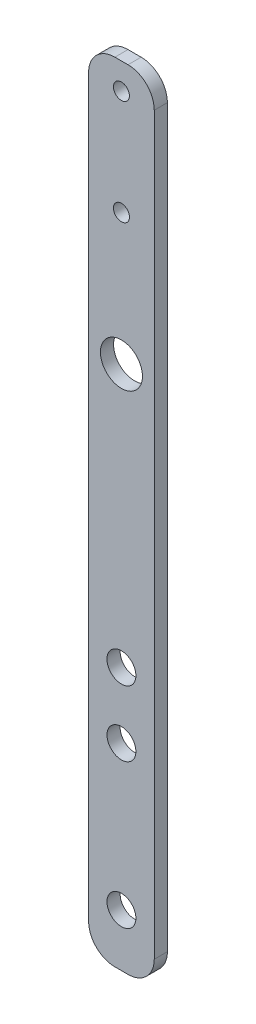
ISO-10303-21;
HEADER;
FILE_DESCRIPTION(('STEP AP214'),'2;1');
FILE_NAME('part.step','',(''),(''),'','','');
FILE_SCHEMA(('AUTOMOTIVE_DESIGN { 1 0 10303 214 1 1 1 1 }'));
ENDSEC;
DATA;
#1=APPLICATION_CONTEXT('core data for automotive mechanical design processes');
#2=APPLICATION_PROTOCOL_DEFINITION('international standard','automotive_design',2000,#1);
#3=PRODUCT_CONTEXT('',#1,'mechanical');
#4=PRODUCT('Part','Part','',(#3));
#5=PRODUCT_RELATED_PRODUCT_CATEGORY('part','',(#4));
#6=PRODUCT_DEFINITION_FORMATION('','',#4);
#7=PRODUCT_DEFINITION_CONTEXT('part definition',#1,'design');
#8=PRODUCT_DEFINITION('design','',#6,#7);
#9=PRODUCT_DEFINITION_SHAPE('','',#8);
#10=(LENGTH_UNIT() NAMED_UNIT(*) SI_UNIT(.MILLI.,.METRE.));
#11=(NAMED_UNIT(*) PLANE_ANGLE_UNIT() SI_UNIT($,.RADIAN.));
#12=(NAMED_UNIT(*) SI_UNIT($,.STERADIAN.) SOLID_ANGLE_UNIT());
#13=UNCERTAINTY_MEASURE_WITH_UNIT(LENGTH_MEASURE(1.E-05),#10,'distance_accuracy_value','');
#14=(GEOMETRIC_REPRESENTATION_CONTEXT(3) GLOBAL_UNCERTAINTY_ASSIGNED_CONTEXT((#13)) GLOBAL_UNIT_ASSIGNED_CONTEXT((#10,
#11,#12)) REPRESENTATION_CONTEXT('',''));
#15=CARTESIAN_POINT('',(0.,0.,0.));
#16=DIRECTION('',(0.,0.,1.));
#17=DIRECTION('',(1.,0.,0.));
#18=AXIS2_PLACEMENT_3D('',#15,#16,#17);
#19=CARTESIAN_POINT('',(12.5,-150.,-5.));
#20=DIRECTION('',(1.,0.,0.));
#21=DIRECTION('',(0.,0.,-0.999999999999996));
#22=AXIS2_PLACEMENT_3D('',#19,#20,#21);
#23=PLANE('',#22);
#24=DIRECTION('',(0.,1.,0.));
#25=VECTOR('',#24,1.);
#26=CARTESIAN_POINT('',(12.5,-150.,0.));
#27=LINE('',#26,#25);
#28=CARTESIAN_POINT('',(12.5,-140.,0.));
#29=VERTEX_POINT('',#28);
#30=CARTESIAN_POINT('',(12.5,140.,0.));
#31=VERTEX_POINT('',#30);
#32=EDGE_CURVE('E165',#29,#31,#27,.T.);
#33=ORIENTED_EDGE('',*,*,#32,.F.);
#34=DIRECTION('',(0.,0.,0.999999999999996));
#35=VECTOR('',#34,1.);
#36=CARTESIAN_POINT('',(12.5,-140.,-5.));
#37=LINE('',#36,#35);
#38=CARTESIAN_POINT('',(12.5,-140.,-5.));
#39=VERTEX_POINT('',#38);
#40=EDGE_CURVE('E146',#29,#39,#37,.F.);
#41=ORIENTED_EDGE('',*,*,#40,.T.);
#42=DIRECTION('',(0.,1.,0.));
#43=VECTOR('',#42,1.);
#44=CARTESIAN_POINT('',(12.5,-150.,-5.));
#45=LINE('',#44,#43);
#46=CARTESIAN_POINT('',(12.5,140.,-5.));
#47=VERTEX_POINT('',#46);
#48=EDGE_CURVE('E127',#39,#47,#45,.T.);
#49=ORIENTED_EDGE('',*,*,#48,.T.);
#50=DIRECTION('',(0.,0.,0.999999999999996));
#51=VECTOR('',#50,1.);
#52=CARTESIAN_POINT('',(12.5,140.,-5.));
#53=LINE('',#52,#51);
#54=EDGE_CURVE('E143',#47,#31,#53,.T.);
#55=ORIENTED_EDGE('',*,*,#54,.T.);
#56=EDGE_LOOP('',(#33,#41,#49,#55));
#57=FACE_BOUND('',#56,.T.);
#58=ADVANCED_FACE('F41',(#57),#23,.T.);
#59=CARTESIAN_POINT('',(-12.5,-150.,-4.99999999999998));
#60=DIRECTION('',(0.,-1.,0.));
#61=DIRECTION('',(0.,0.,-0.999999999999996));
#62=AXIS2_PLACEMENT_3D('',#59,#60,#61);
#63=PLANE('',#62);
#64=DIRECTION('',(1.,0.,0.));
#65=VECTOR('',#64,1.);
#66=CARTESIAN_POINT('',(-12.5,-150.,-4.99999999999998));
#67=LINE('',#66,#65);
#68=CARTESIAN_POINT('',(-2.5,-150.,-4.99999999999998));
#69=VERTEX_POINT('',#68);
#70=CARTESIAN_POINT('',(2.5,-150.,-5.));
#71=VERTEX_POINT('',#70);
#72=EDGE_CURVE('E132',#69,#71,#67,.T.);
#73=ORIENTED_EDGE('',*,*,#72,.T.);
#74=DIRECTION('',(0.,0.,0.999999999999996));
#75=VECTOR('',#74,1.);
#76=CARTESIAN_POINT('',(2.5,-150.,-5.));
#77=LINE('',#76,#75);
#78=CARTESIAN_POINT('',(2.5,-150.,0.));
#79=VERTEX_POINT('',#78);
#80=EDGE_CURVE('E126',#71,#79,#77,.T.);
#81=ORIENTED_EDGE('',*,*,#80,.T.);
#82=DIRECTION('',(1.,0.,0.));
#83=VECTOR('',#82,1.);
#84=CARTESIAN_POINT('',(-12.5,-150.,0.));
#85=LINE('',#84,#83);
#86=CARTESIAN_POINT('',(-2.5,-150.,0.));
#87=VERTEX_POINT('',#86);
#88=EDGE_CURVE('E109',#87,#79,#85,.T.);
#89=ORIENTED_EDGE('',*,*,#88,.F.);
#90=DIRECTION('',(0.,0.,0.999999999999996));
#91=VECTOR('',#90,1.);
#92=CARTESIAN_POINT('',(-2.5,-150.,-4.99999999999998));
#93=LINE('',#92,#91);
#94=EDGE_CURVE('E123',#87,#69,#93,.F.);
#95=ORIENTED_EDGE('',*,*,#94,.T.);
#96=EDGE_LOOP('',(#73,#81,#89,#95));
#97=FACE_BOUND('',#96,.T.);
#98=ADVANCED_FACE('F122',(#97),#63,.T.);
#99=CARTESIAN_POINT('',(-12.5,-150.,-4.99999999999998));
#100=DIRECTION('',(-1.,0.,0.));
#101=DIRECTION('',(0.,0.,0.999999999999996));
#102=AXIS2_PLACEMENT_3D('',#99,#100,#101);
#103=PLANE('',#102);
#104=DIRECTION('',(0.,-1.,0.));
#105=VECTOR('',#104,1.);
#106=CARTESIAN_POINT('',(-12.5,-150.,-4.99999999999998));
#107=LINE('',#106,#105);
#108=CARTESIAN_POINT('',(-12.5,140.,-4.99999999999998));
#109=VERTEX_POINT('',#108);
#110=CARTESIAN_POINT('',(-12.5,-140.,-4.99999999999998));
#111=VERTEX_POINT('',#110);
#112=EDGE_CURVE('E136',#109,#111,#107,.T.);
#113=ORIENTED_EDGE('',*,*,#112,.T.);
#114=DIRECTION('',(0.,0.,0.999999999999996));
#115=VECTOR('',#114,1.);
#116=CARTESIAN_POINT('',(-12.5,-140.,-4.99999999999998));
#117=LINE('',#116,#115);
#118=CARTESIAN_POINT('',(-12.5,-140.,0.));
#119=VERTEX_POINT('',#118);
#120=EDGE_CURVE('E156',#111,#119,#117,.T.);
#121=ORIENTED_EDGE('',*,*,#120,.T.);
#122=DIRECTION('',(0.,-1.,0.));
#123=VECTOR('',#122,1.);
#124=CARTESIAN_POINT('',(-12.5,-150.,0.));
#125=LINE('',#124,#123);
#126=CARTESIAN_POINT('',(-12.5,140.,0.));
#127=VERTEX_POINT('',#126);
#128=EDGE_CURVE('E111',#127,#119,#125,.T.);
#129=ORIENTED_EDGE('',*,*,#128,.F.);
#130=DIRECTION('',(0.,0.,0.999999999999996));
#131=VECTOR('',#130,1.);
#132=CARTESIAN_POINT('',(-12.5,140.,-4.99999999999998));
#133=LINE('',#132,#131);
#134=EDGE_CURVE('E154',#127,#109,#133,.F.);
#135=ORIENTED_EDGE('',*,*,#134,.T.);
#136=EDGE_LOOP('',(#113,#121,#129,#135));
#137=FACE_BOUND('',#136,.T.);
#138=ADVANCED_FACE('F254',(#137),#103,.T.);
#139=CARTESIAN_POINT('',(-12.5,150.,-4.99999999999998));
#140=DIRECTION('',(0.,1.,0.));
#141=DIRECTION('',(0.,0.,0.999999999999996));
#142=AXIS2_PLACEMENT_3D('',#139,#140,#141);
#143=PLANE('',#142);
#144=DIRECTION('',(-1.,0.,0.));
#145=VECTOR('',#144,1.);
#146=CARTESIAN_POINT('',(-12.5,150.,0.));
#147=LINE('',#146,#145);
#148=CARTESIAN_POINT('',(2.5,150.,0.));
#149=VERTEX_POINT('',#148);
#150=CARTESIAN_POINT('',(-2.5,150.,0.));
#151=VERTEX_POINT('',#150);
#152=EDGE_CURVE('E161',#149,#151,#147,.T.);
#153=ORIENTED_EDGE('',*,*,#152,.F.);
#154=DIRECTION('',(0.,0.,0.999999999999996));
#155=VECTOR('',#154,1.);
#156=CARTESIAN_POINT('',(2.50000000000001,150.,-5.));
#157=LINE('',#156,#155);
#158=CARTESIAN_POINT('',(2.50000000000001,150.,-5.));
#159=VERTEX_POINT('',#158);
#160=EDGE_CURVE('E11',#149,#159,#157,.F.);
#161=ORIENTED_EDGE('',*,*,#160,.T.);
#162=DIRECTION('',(-1.,0.,0.));
#163=VECTOR('',#162,1.);
#164=CARTESIAN_POINT('',(-12.5,150.,-4.99999999999998));
#165=LINE('',#164,#163);
#166=CARTESIAN_POINT('',(-2.5,150.,-4.99999999999998));
#167=VERTEX_POINT('',#166);
#168=EDGE_CURVE('E162',#159,#167,#165,.T.);
#169=ORIENTED_EDGE('',*,*,#168,.T.);
#170=DIRECTION('',(0.,0.,0.999999999999996));
#171=VECTOR('',#170,1.);
#172=CARTESIAN_POINT('',(-2.5,150.,-4.99999999999998));
#173=LINE('',#172,#171);
#174=EDGE_CURVE('E49',#167,#151,#173,.T.);
#175=ORIENTED_EDGE('',*,*,#174,.T.);
#176=EDGE_LOOP('',(#153,#161,#169,#175));
#177=FACE_BOUND('',#176,.T.);
#178=ADVANCED_FACE('F160',(#177),#143,.T.);
#179=CARTESIAN_POINT('',(0.,0.,-5.));
#180=DIRECTION('',(0.,0.,-0.999999999999996));
#181=DIRECTION('',(-1.,0.,0.));
#182=AXIS2_PLACEMENT_3D('',#179,#180,#181);
#183=PLANE('',#182);
#184=CARTESIAN_POINT('',(0.,-130.,-5.));
#185=DIRECTION('',(0.,0.,0.999999999999996));
#186=DIRECTION('',(1.,0.,0.));
#187=AXIS2_PLACEMENT_3D('',#184,#185,#186);
#188=CIRCLE('',#187,5.5);
#189=CARTESIAN_POINT('',(5.5,-130.,-5.));
#190=VERTEX_POINT('',#189);
#191=EDGE_CURVE('E202',#190,#190,#188,.T.);
#192=ORIENTED_EDGE('',*,*,#191,.T.);
#193=EDGE_LOOP('',(#192));
#194=FACE_BOUND('',#193,.T.);
#195=CARTESIAN_POINT('',(0.,-50.,-5.));
#196=DIRECTION('',(0.,0.,0.999999999999996));
#197=DIRECTION('',(1.,0.,0.));
#198=AXIS2_PLACEMENT_3D('',#195,#196,#197);
#199=CIRCLE('',#198,5.50000000000001);
#200=CARTESIAN_POINT('',(5.50000000000001,-50.,-5.));
#201=VERTEX_POINT('',#200);
#202=EDGE_CURVE('E196',#201,#201,#199,.T.);
#203=ORIENTED_EDGE('',*,*,#202,.T.);
#204=EDGE_LOOP('',(#203));
#205=FACE_BOUND('',#204,.T.);
#206=CARTESIAN_POINT('',(0.,-75.,-5.));
#207=DIRECTION('',(0.,0.,0.999999999999996));
#208=DIRECTION('',(1.,0.,0.));
#209=AXIS2_PLACEMENT_3D('',#206,#207,#208);
#210=CIRCLE('',#209,5.50000000000001);
#211=CARTESIAN_POINT('',(5.50000000000001,-75.,-5.));
#212=VERTEX_POINT('',#211);
#213=EDGE_CURVE('E190',#212,#212,#210,.T.);
#214=ORIENTED_EDGE('',*,*,#213,.T.);
#215=EDGE_LOOP('',(#214));
#216=FACE_BOUND('',#215,.T.);
#217=CARTESIAN_POINT('',(0.,140.,-5.));
#218=DIRECTION('',(0.,0.,0.999999999999996));
#219=DIRECTION('',(1.,0.,0.));
#220=AXIS2_PLACEMENT_3D('',#217,#218,#219);
#221=CIRCLE('',#220,3.05);
#222=CARTESIAN_POINT('',(3.05,140.,-5.));
#223=VERTEX_POINT('',#222);
#224=EDGE_CURVE('E184',#223,#223,#221,.T.);
#225=ORIENTED_EDGE('',*,*,#224,.T.);
#226=EDGE_LOOP('',(#225));
#227=FACE_BOUND('',#226,.T.);
#228=CARTESIAN_POINT('',(0.,100.,-5.));
#229=DIRECTION('',(0.,0.,0.999999999999996));
#230=DIRECTION('',(1.,0.,0.));
#231=AXIS2_PLACEMENT_3D('',#228,#229,#230);
#232=CIRCLE('',#231,3.05);
#233=CARTESIAN_POINT('',(3.05,100.,-5.));
#234=VERTEX_POINT('',#233);
#235=EDGE_CURVE('E178',#234,#234,#232,.T.);
#236=ORIENTED_EDGE('',*,*,#235,.T.);
#237=EDGE_LOOP('',(#236));
#238=FACE_BOUND('',#237,.T.);
#239=CARTESIAN_POINT('',(0.,50.,-5.));
#240=DIRECTION('',(0.,0.,0.999999999999996));
#241=DIRECTION('',(1.,0.,0.));
#242=AXIS2_PLACEMENT_3D('',#239,#240,#241);
#243=CIRCLE('',#242,8.);
#244=CARTESIAN_POINT('',(8.,50.,-5.));
#245=VERTEX_POINT('',#244);
#246=EDGE_CURVE('E167',#245,#245,#243,.T.);
#247=ORIENTED_EDGE('',*,*,#246,.T.);
#248=EDGE_LOOP('',(#247));
#249=FACE_BOUND('',#248,.T.);
#250=ORIENTED_EDGE('',*,*,#48,.F.);
#251=CARTESIAN_POINT('',(2.5,-140.,-5.));
#252=DIRECTION('',(0.,0.,-0.999999999999996));
#253=DIRECTION('',(-1.,0.,0.));
#254=AXIS2_PLACEMENT_3D('',#251,#252,#253);
#255=CIRCLE('',#254,10.);
#256=EDGE_CURVE('E152',#39,#71,#255,.T.);
#257=ORIENTED_EDGE('',*,*,#256,.T.);
#258=ORIENTED_EDGE('',*,*,#72,.F.);
#259=CARTESIAN_POINT('',(-2.5,-140.,-4.99999999999998));
#260=DIRECTION('',(0.,0.,-0.999999999999996));
#261=DIRECTION('',(-1.,0.,0.));
#262=AXIS2_PLACEMENT_3D('',#259,#260,#261);
#263=CIRCLE('',#262,10.);
#264=EDGE_CURVE('E131',#69,#111,#263,.T.);
#265=ORIENTED_EDGE('',*,*,#264,.T.);
#266=ORIENTED_EDGE('',*,*,#112,.F.);
#267=CARTESIAN_POINT('',(-2.5,140.,-4.99999999999998));
#268=DIRECTION('',(0.,0.,-0.999999999999996));
#269=DIRECTION('',(-1.,0.,0.));
#270=AXIS2_PLACEMENT_3D('',#267,#268,#269);
#271=CIRCLE('',#270,10.);
#272=EDGE_CURVE('E56',#109,#167,#271,.T.);
#273=ORIENTED_EDGE('',*,*,#272,.T.);
#274=ORIENTED_EDGE('',*,*,#168,.F.);
#275=CARTESIAN_POINT('',(2.5,140.,-5.));
#276=DIRECTION('',(0.,0.,-0.999999999999996));
#277=DIRECTION('',(-1.,0.,0.));
#278=AXIS2_PLACEMENT_3D('',#275,#276,#277);
#279=CIRCLE('',#278,10.);
#280=EDGE_CURVE('E149',#159,#47,#279,.T.);
#281=ORIENTED_EDGE('',*,*,#280,.T.);
#282=EDGE_LOOP('',(#250,#257,#258,#265,#266,#273,#274,#281));
#283=FACE_BOUND('',#282,.T.);
#284=ADVANCED_FACE('F211',(#194,#205,#216,#227,#238,#249,#283),#183,.T.);
#285=CARTESIAN_POINT('',(0.,0.,0.));
#286=DIRECTION('',(0.,0.,-0.999999999999996));
#287=DIRECTION('',(-1.,0.,0.));
#288=AXIS2_PLACEMENT_3D('',#285,#286,#287);
#289=PLANE('',#288);
#290=CARTESIAN_POINT('',(0.,-130.,0.));
#291=DIRECTION('',(0.,0.,0.999999999999996));
#292=DIRECTION('',(1.,0.,0.));
#293=AXIS2_PLACEMENT_3D('',#290,#291,#292);
#294=CIRCLE('',#293,5.5);
#295=CARTESIAN_POINT('',(5.5,-130.,0.));
#296=VERTEX_POINT('',#295);
#297=EDGE_CURVE('E205',#296,#296,#294,.T.);
#298=ORIENTED_EDGE('',*,*,#297,.F.);
#299=EDGE_LOOP('',(#298));
#300=FACE_BOUND('',#299,.T.);
#301=CARTESIAN_POINT('',(0.,-50.,0.));
#302=DIRECTION('',(0.,0.,0.999999999999996));
#303=DIRECTION('',(1.,0.,0.));
#304=AXIS2_PLACEMENT_3D('',#301,#302,#303);
#305=CIRCLE('',#304,5.50000000000001);
#306=CARTESIAN_POINT('',(5.50000000000001,-50.,0.));
#307=VERTEX_POINT('',#306);
#308=EDGE_CURVE('E199',#307,#307,#305,.T.);
#309=ORIENTED_EDGE('',*,*,#308,.F.);
#310=EDGE_LOOP('',(#309));
#311=FACE_BOUND('',#310,.T.);
#312=CARTESIAN_POINT('',(0.,-75.,0.));
#313=DIRECTION('',(0.,0.,0.999999999999996));
#314=DIRECTION('',(1.,0.,0.));
#315=AXIS2_PLACEMENT_3D('',#312,#313,#314);
#316=CIRCLE('',#315,5.50000000000001);
#317=CARTESIAN_POINT('',(5.50000000000001,-75.,0.));
#318=VERTEX_POINT('',#317);
#319=EDGE_CURVE('E193',#318,#318,#316,.T.);
#320=ORIENTED_EDGE('',*,*,#319,.F.);
#321=EDGE_LOOP('',(#320));
#322=FACE_BOUND('',#321,.T.);
#323=CARTESIAN_POINT('',(0.,140.,0.));
#324=DIRECTION('',(0.,0.,0.999999999999996));
#325=DIRECTION('',(1.,0.,0.));
#326=AXIS2_PLACEMENT_3D('',#323,#324,#325);
#327=CIRCLE('',#326,3.05);
#328=CARTESIAN_POINT('',(3.05,140.,0.));
#329=VERTEX_POINT('',#328);
#330=EDGE_CURVE('E187',#329,#329,#327,.T.);
#331=ORIENTED_EDGE('',*,*,#330,.F.);
#332=EDGE_LOOP('',(#331));
#333=FACE_BOUND('',#332,.T.);
#334=CARTESIAN_POINT('',(0.,100.,0.));
#335=DIRECTION('',(0.,0.,0.999999999999996));
#336=DIRECTION('',(1.,0.,0.));
#337=AXIS2_PLACEMENT_3D('',#334,#335,#336);
#338=CIRCLE('',#337,3.05);
#339=CARTESIAN_POINT('',(3.05,100.,0.));
#340=VERTEX_POINT('',#339);
#341=EDGE_CURVE('E181',#340,#340,#338,.T.);
#342=ORIENTED_EDGE('',*,*,#341,.F.);
#343=EDGE_LOOP('',(#342));
#344=FACE_BOUND('',#343,.T.);
#345=CARTESIAN_POINT('',(0.,50.,0.));
#346=DIRECTION('',(0.,0.,0.999999999999996));
#347=DIRECTION('',(1.,0.,0.));
#348=AXIS2_PLACEMENT_3D('',#345,#346,#347);
#349=CIRCLE('',#348,8.);
#350=CARTESIAN_POINT('',(8.,50.,0.));
#351=VERTEX_POINT('',#350);
#352=EDGE_CURVE('E175',#351,#351,#349,.T.);
#353=ORIENTED_EDGE('',*,*,#352,.F.);
#354=EDGE_LOOP('',(#353));
#355=FACE_BOUND('',#354,.T.);
#356=ORIENTED_EDGE('',*,*,#88,.T.);
#357=CARTESIAN_POINT('',(2.5,-140.,0.));
#358=DIRECTION('',(0.,0.,-0.999999999999996));
#359=DIRECTION('',(-1.,0.,0.));
#360=AXIS2_PLACEMENT_3D('',#357,#358,#359);
#361=CIRCLE('',#360,10.);
#362=EDGE_CURVE('E116',#79,#29,#361,.F.);
#363=ORIENTED_EDGE('',*,*,#362,.T.);
#364=ORIENTED_EDGE('',*,*,#32,.T.);
#365=CARTESIAN_POINT('',(2.5,140.,0.));
#366=DIRECTION('',(0.,0.,-0.999999999999996));
#367=DIRECTION('',(-1.,0.,0.));
#368=AXIS2_PLACEMENT_3D('',#365,#366,#367);
#369=CIRCLE('',#368,10.);
#370=EDGE_CURVE('E117',#31,#149,#369,.F.);
#371=ORIENTED_EDGE('',*,*,#370,.T.);
#372=ORIENTED_EDGE('',*,*,#152,.T.);
#373=CARTESIAN_POINT('',(-2.5,140.,0.));
#374=DIRECTION('',(0.,0.,-0.999999999999996));
#375=DIRECTION('',(-1.,0.,0.));
#376=AXIS2_PLACEMENT_3D('',#373,#374,#375);
#377=CIRCLE('',#376,10.);
#378=EDGE_CURVE('E134',#151,#127,#377,.F.);
#379=ORIENTED_EDGE('',*,*,#378,.T.);
#380=ORIENTED_EDGE('',*,*,#128,.T.);
#381=CARTESIAN_POINT('',(-2.5,-140.,0.));
#382=DIRECTION('',(0.,0.,-0.999999999999996));
#383=DIRECTION('',(-1.,0.,0.));
#384=AXIS2_PLACEMENT_3D('',#381,#382,#383);
#385=CIRCLE('',#384,10.);
#386=EDGE_CURVE('E106',#119,#87,#385,.F.);
#387=ORIENTED_EDGE('',*,*,#386,.T.);
#388=EDGE_LOOP('',(#356,#363,#364,#371,#372,#379,#380,#387));
#389=FACE_BOUND('',#388,.T.);
#390=ADVANCED_FACE('F108',(#300,#311,#322,#333,#344,#355,#389),#289,.F.);
#391=CARTESIAN_POINT('',(0.,50.,-5.));
#392=DIRECTION('',(0.,0.,0.999999999999996));
#393=DIRECTION('',(1.,0.,0.));
#394=AXIS2_PLACEMENT_3D('',#391,#392,#393);
#395=CYLINDRICAL_SURFACE('',#394,8.);
#396=ORIENTED_EDGE('',*,*,#246,.F.);
#397=EDGE_LOOP('',(#396));
#398=FACE_BOUND('',#397,.T.);
#399=ORIENTED_EDGE('',*,*,#352,.T.);
#400=EDGE_LOOP('',(#399));
#401=FACE_BOUND('',#400,.T.);
#402=ADVANCED_FACE('F224',(#398,#401),#395,.F.);
#403=CARTESIAN_POINT('',(0.,100.,-5.));
#404=DIRECTION('',(0.,0.,0.999999999999996));
#405=DIRECTION('',(1.,0.,0.));
#406=AXIS2_PLACEMENT_3D('',#403,#404,#405);
#407=CYLINDRICAL_SURFACE('',#406,3.05);
#408=ORIENTED_EDGE('',*,*,#235,.F.);
#409=EDGE_LOOP('',(#408));
#410=FACE_BOUND('',#409,.T.);
#411=ORIENTED_EDGE('',*,*,#341,.T.);
#412=EDGE_LOOP('',(#411));
#413=FACE_BOUND('',#412,.T.);
#414=ADVANCED_FACE('F237',(#410,#413),#407,.F.);
#415=CARTESIAN_POINT('',(0.,140.,-5.));
#416=DIRECTION('',(0.,0.,0.999999999999996));
#417=DIRECTION('',(1.,0.,0.));
#418=AXIS2_PLACEMENT_3D('',#415,#416,#417);
#419=CYLINDRICAL_SURFACE('',#418,3.05);
#420=ORIENTED_EDGE('',*,*,#224,.F.);
#421=EDGE_LOOP('',(#420));
#422=FACE_BOUND('',#421,.T.);
#423=ORIENTED_EDGE('',*,*,#330,.T.);
#424=EDGE_LOOP('',(#423));
#425=FACE_BOUND('',#424,.T.);
#426=ADVANCED_FACE('F243',(#422,#425),#419,.F.);
#427=CARTESIAN_POINT('',(0.,-75.,-5.));
#428=DIRECTION('',(0.,0.,0.999999999999996));
#429=DIRECTION('',(1.,0.,0.));
#430=AXIS2_PLACEMENT_3D('',#427,#428,#429);
#431=CYLINDRICAL_SURFACE('',#430,5.50000000000001);
#432=ORIENTED_EDGE('',*,*,#213,.F.);
#433=EDGE_LOOP('',(#432));
#434=FACE_BOUND('',#433,.T.);
#435=ORIENTED_EDGE('',*,*,#319,.T.);
#436=EDGE_LOOP('',(#435));
#437=FACE_BOUND('',#436,.T.);
#438=ADVANCED_FACE('F361',(#434,#437),#431,.F.);
#439=CARTESIAN_POINT('',(0.,-50.,-5.));
#440=DIRECTION('',(0.,0.,0.999999999999996));
#441=DIRECTION('',(1.,0.,0.));
#442=AXIS2_PLACEMENT_3D('',#439,#440,#441);
#443=CYLINDRICAL_SURFACE('',#442,5.50000000000001);
#444=ORIENTED_EDGE('',*,*,#202,.F.);
#445=EDGE_LOOP('',(#444));
#446=FACE_BOUND('',#445,.T.);
#447=ORIENTED_EDGE('',*,*,#308,.T.);
#448=EDGE_LOOP('',(#447));
#449=FACE_BOUND('',#448,.T.);
#450=ADVANCED_FACE('F218',(#446,#449),#443,.F.);
#451=CARTESIAN_POINT('',(0.,-130.,-5.));
#452=DIRECTION('',(0.,0.,0.999999999999996));
#453=DIRECTION('',(1.,0.,0.));
#454=AXIS2_PLACEMENT_3D('',#451,#452,#453);
#455=CYLINDRICAL_SURFACE('',#454,5.5);
#456=ORIENTED_EDGE('',*,*,#191,.F.);
#457=EDGE_LOOP('',(#456));
#458=FACE_BOUND('',#457,.T.);
#459=ORIENTED_EDGE('',*,*,#297,.T.);
#460=EDGE_LOOP('',(#459));
#461=FACE_BOUND('',#460,.T.);
#462=ADVANCED_FACE('F214',(#458,#461),#455,.F.);
#463=CARTESIAN_POINT('',(2.5,-140.,-5.));
#464=DIRECTION('',(0.,0.,0.999999999999996));
#465=DIRECTION('',(1.,0.,0.));
#466=AXIS2_PLACEMENT_3D('',#463,#464,#465);
#467=CYLINDRICAL_SURFACE('',#466,10.);
#468=ORIENTED_EDGE('',*,*,#256,.F.);
#469=ORIENTED_EDGE('',*,*,#40,.F.);
#470=ORIENTED_EDGE('',*,*,#362,.F.);
#471=ORIENTED_EDGE('',*,*,#80,.F.);
#472=EDGE_LOOP('',(#468,#469,#470,#471));
#473=FACE_BOUND('',#472,.T.);
#474=ADVANCED_FACE('F217',(#473),#467,.T.);
#475=CARTESIAN_POINT('',(-2.5,-140.,-4.99999999999998));
#476=DIRECTION('',(0.,0.,0.999999999999996));
#477=DIRECTION('',(1.,0.,0.));
#478=AXIS2_PLACEMENT_3D('',#475,#476,#477);
#479=CYLINDRICAL_SURFACE('',#478,10.);
#480=ORIENTED_EDGE('',*,*,#264,.F.);
#481=ORIENTED_EDGE('',*,*,#94,.F.);
#482=ORIENTED_EDGE('',*,*,#386,.F.);
#483=ORIENTED_EDGE('',*,*,#120,.F.);
#484=EDGE_LOOP('',(#480,#481,#482,#483));
#485=FACE_BOUND('',#484,.T.);
#486=ADVANCED_FACE('F130',(#485),#479,.T.);
#487=CARTESIAN_POINT('',(2.5,140.,-5.));
#488=DIRECTION('',(0.,0.,0.999999999999996));
#489=DIRECTION('',(1.,0.,0.));
#490=AXIS2_PLACEMENT_3D('',#487,#488,#489);
#491=CYLINDRICAL_SURFACE('',#490,10.);
#492=ORIENTED_EDGE('',*,*,#280,.F.);
#493=ORIENTED_EDGE('',*,*,#160,.F.);
#494=ORIENTED_EDGE('',*,*,#370,.F.);
#495=ORIENTED_EDGE('',*,*,#54,.F.);
#496=EDGE_LOOP('',(#492,#493,#494,#495));
#497=FACE_BOUND('',#496,.T.);
#498=ADVANCED_FACE('F264',(#497),#491,.T.);
#499=CARTESIAN_POINT('',(-2.5,140.,-4.99999999999998));
#500=DIRECTION('',(0.,0.,0.999999999999996));
#501=DIRECTION('',(1.,0.,0.));
#502=AXIS2_PLACEMENT_3D('',#499,#500,#501);
#503=CYLINDRICAL_SURFACE('',#502,10.);
#504=ORIENTED_EDGE('',*,*,#272,.F.);
#505=ORIENTED_EDGE('',*,*,#134,.F.);
#506=ORIENTED_EDGE('',*,*,#378,.F.);
#507=ORIENTED_EDGE('',*,*,#174,.F.);
#508=EDGE_LOOP('',(#504,#505,#506,#507));
#509=FACE_BOUND('',#508,.T.);
#510=ADVANCED_FACE('F43',(#509),#503,.T.);
#511=CLOSED_SHELL('',(#58,#98,#138,#178,#284,#390,#402,#414,#426,#438,#450,#462,#474,#486,#498,#510));
#512=MANIFOLD_SOLID_BREP('B2',#511);
#513=ADVANCED_BREP_SHAPE_REPRESENTATION('',(#18,#512),#14);
#514=SHAPE_DEFINITION_REPRESENTATION(#9,#513);
ENDSEC;
END-ISO-10303-21;
